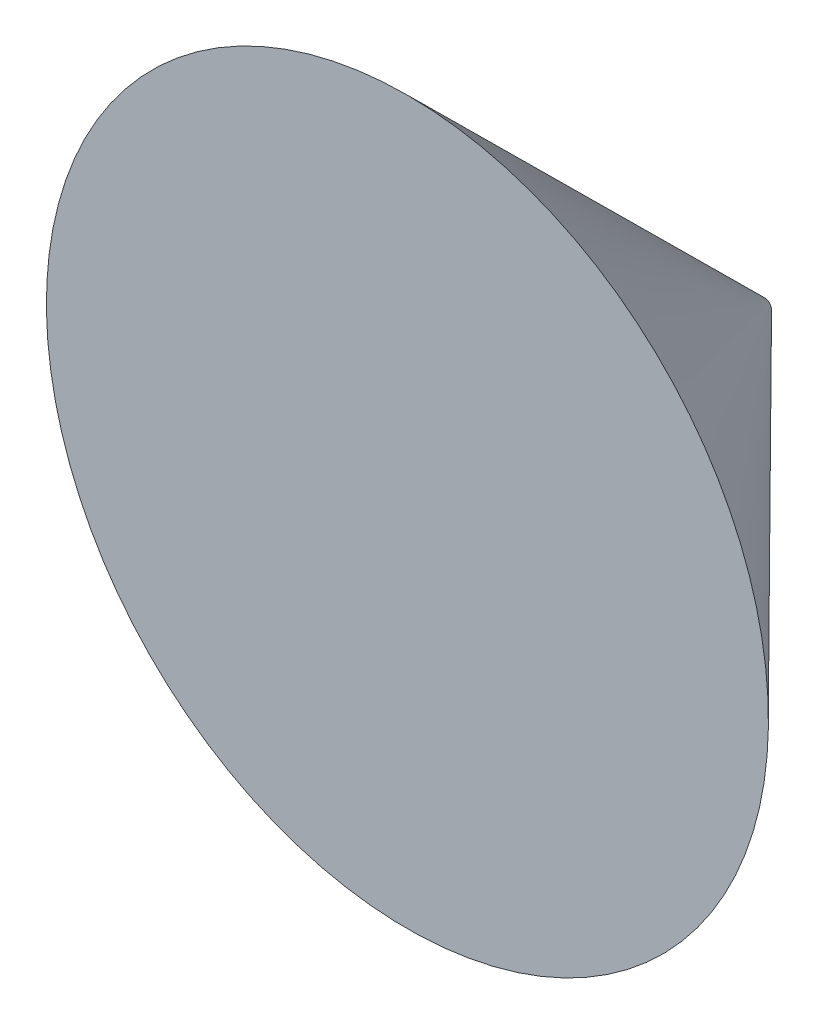
ISO-10303-21;
HEADER;
FILE_DESCRIPTION(('STEP AP214'),'2;1');
FILE_NAME('part.step','',(''),(''),'','','');
FILE_SCHEMA(('AUTOMOTIVE_DESIGN { 1 0 10303 214 1 1 1 1 }'));
ENDSEC;
DATA;
#1=APPLICATION_CONTEXT('core data for automotive mechanical design processes');
#2=APPLICATION_PROTOCOL_DEFINITION('international standard','automotive_design',2000,#1);
#3=PRODUCT_CONTEXT('',#1,'mechanical');
#4=PRODUCT('Part','Part','',(#3));
#5=PRODUCT_RELATED_PRODUCT_CATEGORY('part','',(#4));
#6=PRODUCT_DEFINITION_FORMATION('','',#4);
#7=PRODUCT_DEFINITION_CONTEXT('part definition',#1,'design');
#8=PRODUCT_DEFINITION('design','',#6,#7);
#9=PRODUCT_DEFINITION_SHAPE('','',#8);
#10=(LENGTH_UNIT() NAMED_UNIT(*) SI_UNIT(.MILLI.,.METRE.));
#11=(NAMED_UNIT(*) PLANE_ANGLE_UNIT() SI_UNIT($,.RADIAN.));
#12=(NAMED_UNIT(*) SI_UNIT($,.STERADIAN.) SOLID_ANGLE_UNIT());
#13=UNCERTAINTY_MEASURE_WITH_UNIT(LENGTH_MEASURE(1.E-05),#10,'distance_accuracy_value','');
#14=(GEOMETRIC_REPRESENTATION_CONTEXT(3) GLOBAL_UNCERTAINTY_ASSIGNED_CONTEXT((#13)) GLOBAL_UNIT_ASSIGNED_CONTEXT((#10,
#11,#12)) REPRESENTATION_CONTEXT('',''));
#15=CARTESIAN_POINT('',(0.,0.,0.));
#16=DIRECTION('',(0.,0.,1.));
#17=DIRECTION('',(1.,0.,0.));
#18=AXIS2_PLACEMENT_3D('',#15,#16,#17);
#19=CARTESIAN_POINT('',(0.,4.,0.));
#20=DIRECTION('',(0.,0.,-1.));
#21=DIRECTION('',(0.,1.,0.));
#22=AXIS2_PLACEMENT_3D('',#19,#20,#21);
#23=PLANE('',#22);
#24=CARTESIAN_POINT('',(0.,0.,0.));
#25=DIRECTION('',(0.,0.,-1.));
#26=DIRECTION('',(0.,1.,0.));
#27=AXIS2_PLACEMENT_3D('',#24,#25,#26);
#28=CIRCLE('',#27,4.);
#29=CARTESIAN_POINT('',(0.,4.,0.));
#30=VERTEX_POINT('',#29);
#31=EDGE_CURVE('E54',#30,#30,#28,.T.);
#32=ORIENTED_EDGE('',*,*,#31,.T.);
#33=EDGE_LOOP('',(#32));
#34=FACE_BOUND('',#33,.T.);
#35=ADVANCED_FACE('F47',(#34),#23,.T.);
#36=CARTESIAN_POINT('',(0.,0.,196.));
#37=DIRECTION('',(0.,0.,1.));
#38=DIRECTION('',(0.,-1.,0.));
#39=AXIS2_PLACEMENT_3D('',#36,#37,#38);
#40=PLANE('',#39);
#41=CARTESIAN_POINT('',(0.,0.,196.));
#42=DIRECTION('',(0.,0.,-1.));
#43=DIRECTION('',(0.,1.,0.));
#44=AXIS2_PLACEMENT_3D('',#41,#42,#43);
#45=CIRCLE('',#44,198.296997276613);
#46=CARTESIAN_POINT('',(0.,198.296997276613,196.));
#47=VERTEX_POINT('',#46);
#48=EDGE_CURVE('E10',#47,#47,#45,.T.);
#49=ORIENTED_EDGE('',*,*,#48,.F.);
#50=EDGE_LOOP('',(#49));
#51=FACE_BOUND('',#50,.T.);
#52=ADVANCED_FACE('F66',(#51),#40,.T.);
#53=CARTESIAN_POINT('',(0.,0.,0.));
#54=DIRECTION('',(0.,0.,1.));
#55=DIRECTION('',(0.,-1.,0.));
#56=AXIS2_PLACEMENT_3D('',#53,#54,#55);
#57=CONICAL_SURFACE('',#56,4.,0.781034840267457);
#58=ORIENTED_EDGE('',*,*,#48,.T.);
#59=EDGE_LOOP('',(#58));
#60=FACE_BOUND('',#59,.T.);
#61=ORIENTED_EDGE('',*,*,#31,.F.);
#62=EDGE_LOOP('',(#61));
#63=FACE_BOUND('',#62,.T.);
#64=ADVANCED_FACE('F64',(#60,#63),#57,.T.);
#65=CLOSED_SHELL('',(#35,#52,#64));
#66=MANIFOLD_SOLID_BREP('B2',#65);
#67=ADVANCED_BREP_SHAPE_REPRESENTATION('',(#18,#66),#14);
#68=SHAPE_DEFINITION_REPRESENTATION(#9,#67);
ENDSEC;
END-ISO-10303-21;
